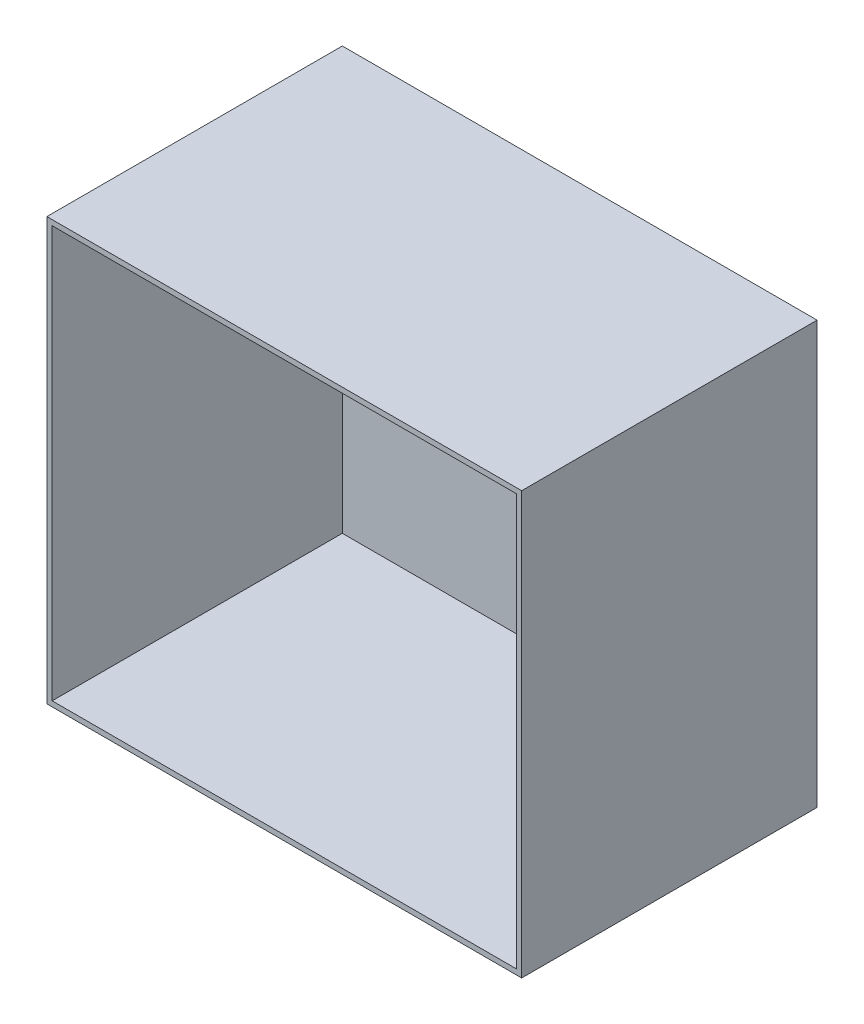
ISO-10303-21;
HEADER;
FILE_DESCRIPTION(('STEP AP214'),'2;1');
FILE_NAME('part.step','',(''),(''),'','','');
FILE_SCHEMA(('AUTOMOTIVE_DESIGN { 1 0 10303 214 1 1 1 1 }'));
ENDSEC;
DATA;
#1=APPLICATION_CONTEXT('core data for automotive mechanical design processes');
#2=APPLICATION_PROTOCOL_DEFINITION('international standard','automotive_design',2000,#1);
#3=PRODUCT_CONTEXT('',#1,'mechanical');
#4=PRODUCT('Part','Part','',(#3));
#5=PRODUCT_RELATED_PRODUCT_CATEGORY('part','',(#4));
#6=PRODUCT_DEFINITION_FORMATION('','',#4);
#7=PRODUCT_DEFINITION_CONTEXT('part definition',#1,'design');
#8=PRODUCT_DEFINITION('design','',#6,#7);
#9=PRODUCT_DEFINITION_SHAPE('','',#8);
#10=(LENGTH_UNIT() NAMED_UNIT(*) SI_UNIT(.MILLI.,.METRE.));
#11=(NAMED_UNIT(*) PLANE_ANGLE_UNIT() SI_UNIT($,.RADIAN.));
#12=(NAMED_UNIT(*) SI_UNIT($,.STERADIAN.) SOLID_ANGLE_UNIT());
#13=UNCERTAINTY_MEASURE_WITH_UNIT(LENGTH_MEASURE(1.E-05),#10,'distance_accuracy_value','');
#14=(GEOMETRIC_REPRESENTATION_CONTEXT(3) GLOBAL_UNCERTAINTY_ASSIGNED_CONTEXT((#13)) GLOBAL_UNIT_ASSIGNED_CONTEXT((#10,
#11,#12)) REPRESENTATION_CONTEXT('',''));
#15=CARTESIAN_POINT('',(0.,0.,0.));
#16=DIRECTION('',(0.,0.,1.));
#17=DIRECTION('',(1.,0.,0.));
#18=AXIS2_PLACEMENT_3D('',#15,#16,#17);
#19=CARTESIAN_POINT('',(-78.,0.,102.));
#20=DIRECTION('',(1.,0.,0.));
#21=DIRECTION('',(0.,0.,-1.));
#22=AXIS2_PLACEMENT_3D('',#19,#20,#21);
#23=PLANE('',#22);
#24=DIRECTION('',(0.,-1.,0.));
#25=VECTOR('',#24,1.);
#26=CARTESIAN_POINT('',(-78.,0.,2.));
#27=LINE('',#26,#25);
#28=CARTESIAN_POINT('',(-78.,78.,2.));
#29=VERTEX_POINT('',#28);
#30=CARTESIAN_POINT('',(-78.,-78.,2.));
#31=VERTEX_POINT('',#30);
#32=EDGE_CURVE('E140',#29,#31,#27,.T.);
#33=ORIENTED_EDGE('',*,*,#32,.F.);
#34=DIRECTION('',(0.,0.,-1.));
#35=VECTOR('',#34,1.);
#36=CARTESIAN_POINT('',(-78.,78.,102.));
#37=LINE('',#36,#35);
#38=CARTESIAN_POINT('',(-78.,78.,112.));
#39=VERTEX_POINT('',#38);
#40=EDGE_CURVE('E148',#39,#29,#37,.T.);
#41=ORIENTED_EDGE('',*,*,#40,.F.);
#42=DIRECTION('',(0.,-1.,0.));
#43=VECTOR('',#42,1.);
#44=CARTESIAN_POINT('',(-78.,78.,112.));
#45=LINE('',#44,#43);
#46=CARTESIAN_POINT('',(-78.,-78.,112.));
#47=VERTEX_POINT('',#46);
#48=EDGE_CURVE('E124',#39,#47,#45,.T.);
#49=ORIENTED_EDGE('',*,*,#48,.T.);
#50=DIRECTION('',(0.,0.,-1.));
#51=VECTOR('',#50,1.);
#52=CARTESIAN_POINT('',(-78.,-78.,102.));
#53=LINE('',#52,#51);
#54=EDGE_CURVE('E110',#47,#31,#53,.T.);
#55=ORIENTED_EDGE('',*,*,#54,.T.);
#56=EDGE_LOOP('',(#33,#41,#49,#55));
#57=FACE_BOUND('',#56,.T.);
#58=ADVANCED_FACE('F37',(#57),#23,.T.);
#59=CARTESIAN_POINT('',(0.,78.,102.));
#60=DIRECTION('',(0.,-1.,0.));
#61=DIRECTION('',(0.,0.,-1.));
#62=AXIS2_PLACEMENT_3D('',#59,#60,#61);
#63=PLANE('',#62);
#64=DIRECTION('',(-1.,0.,0.));
#65=VECTOR('',#64,1.);
#66=CARTESIAN_POINT('',(0.,78.,2.));
#67=LINE('',#66,#65);
#68=CARTESIAN_POINT('',(98.,78.,2.));
#69=VERTEX_POINT('',#68);
#70=EDGE_CURVE('E52',#69,#29,#67,.T.);
#71=ORIENTED_EDGE('',*,*,#70,.F.);
#72=DIRECTION('',(0.,0.,-1.));
#73=VECTOR('',#72,1.);
#74=CARTESIAN_POINT('',(98.,78.,102.));
#75=LINE('',#74,#73);
#76=CARTESIAN_POINT('',(98.,78.,112.));
#77=VERTEX_POINT('',#76);
#78=EDGE_CURVE('E109',#77,#69,#75,.T.);
#79=ORIENTED_EDGE('',*,*,#78,.F.);
#80=DIRECTION('',(-1.,0.,0.));
#81=VECTOR('',#80,1.);
#82=CARTESIAN_POINT('',(98.,78.,112.));
#83=LINE('',#82,#81);
#84=EDGE_CURVE('E122',#77,#39,#83,.T.);
#85=ORIENTED_EDGE('',*,*,#84,.T.);
#86=ORIENTED_EDGE('',*,*,#40,.T.);
#87=EDGE_LOOP('',(#71,#79,#85,#86));
#88=FACE_BOUND('',#87,.T.);
#89=ADVANCED_FACE('F193',(#88),#63,.T.);
#90=CARTESIAN_POINT('',(98.,0.,102.));
#91=DIRECTION('',(-1.,0.,0.));
#92=DIRECTION('',(0.,0.,1.));
#93=AXIS2_PLACEMENT_3D('',#90,#91,#92);
#94=PLANE('',#93);
#95=DIRECTION('',(0.,1.,0.));
#96=VECTOR('',#95,1.);
#97=CARTESIAN_POINT('',(98.,0.,2.));
#98=LINE('',#97,#96);
#99=CARTESIAN_POINT('',(98.,-78.,2.));
#100=VERTEX_POINT('',#99);
#101=EDGE_CURVE('E57',#100,#69,#98,.T.);
#102=ORIENTED_EDGE('',*,*,#101,.F.);
#103=DIRECTION('',(0.,0.,-1.));
#104=VECTOR('',#103,1.);
#105=CARTESIAN_POINT('',(98.,-78.,102.));
#106=LINE('',#105,#104);
#107=CARTESIAN_POINT('',(98.,-78.,112.));
#108=VERTEX_POINT('',#107);
#109=EDGE_CURVE('E101',#108,#100,#106,.T.);
#110=ORIENTED_EDGE('',*,*,#109,.F.);
#111=DIRECTION('',(0.,1.,0.));
#112=VECTOR('',#111,1.);
#113=CARTESIAN_POINT('',(98.,-78.,112.));
#114=LINE('',#113,#112);
#115=EDGE_CURVE('E105',#108,#77,#114,.T.);
#116=ORIENTED_EDGE('',*,*,#115,.T.);
#117=ORIENTED_EDGE('',*,*,#78,.T.);
#118=EDGE_LOOP('',(#102,#110,#116,#117));
#119=FACE_BOUND('',#118,.T.);
#120=ADVANCED_FACE('F103',(#119),#94,.T.);
#121=CARTESIAN_POINT('',(0.,-78.,102.));
#122=DIRECTION('',(0.,1.,0.));
#123=DIRECTION('',(0.,0.,1.));
#124=AXIS2_PLACEMENT_3D('',#121,#122,#123);
#125=PLANE('',#124);
#126=DIRECTION('',(1.,0.,0.));
#127=VECTOR('',#126,1.);
#128=CARTESIAN_POINT('',(0.,-78.,2.));
#129=LINE('',#128,#127);
#130=EDGE_CURVE('E144',#31,#100,#129,.T.);
#131=ORIENTED_EDGE('',*,*,#130,.F.);
#132=ORIENTED_EDGE('',*,*,#54,.F.);
#133=DIRECTION('',(1.,0.,0.));
#134=VECTOR('',#133,1.);
#135=CARTESIAN_POINT('',(-78.,-78.,112.));
#136=LINE('',#135,#134);
#137=EDGE_CURVE('E113',#47,#108,#136,.T.);
#138=ORIENTED_EDGE('',*,*,#137,.T.);
#139=ORIENTED_EDGE('',*,*,#109,.T.);
#140=EDGE_LOOP('',(#131,#132,#138,#139));
#141=FACE_BOUND('',#140,.T.);
#142=ADVANCED_FACE('F114',(#141),#125,.T.);
#143=CARTESIAN_POINT('',(0.,0.,2.));
#144=DIRECTION('',(0.,0.,1.));
#145=DIRECTION('',(1.,0.,0.));
#146=AXIS2_PLACEMENT_3D('',#143,#144,#145);
#147=PLANE('',#146);
#148=ORIENTED_EDGE('',*,*,#32,.T.);
#149=ORIENTED_EDGE('',*,*,#130,.T.);
#150=ORIENTED_EDGE('',*,*,#101,.T.);
#151=ORIENTED_EDGE('',*,*,#70,.T.);
#152=EDGE_LOOP('',(#148,#149,#150,#151));
#153=FACE_BOUND('',#152,.T.);
#154=ADVANCED_FACE('F207',(#153),#147,.T.);
#155=CARTESIAN_POINT('',(0.,0.,112.));
#156=DIRECTION('',(0.,0.,1.));
#157=DIRECTION('',(1.,0.,0.));
#158=AXIS2_PLACEMENT_3D('',#155,#156,#157);
#159=PLANE('',#158);
#160=DIRECTION('',(0.,1.,0.));
#161=VECTOR('',#160,1.);
#162=CARTESIAN_POINT('',(100.,-80.,112.));
#163=LINE('',#162,#161);
#164=CARTESIAN_POINT('',(100.,-80.,112.));
#165=VERTEX_POINT('',#164);
#166=CARTESIAN_POINT('',(100.,80.,112.));
#167=VERTEX_POINT('',#166);
#168=EDGE_CURVE('E128',#165,#167,#163,.T.);
#169=ORIENTED_EDGE('',*,*,#168,.T.);
#170=DIRECTION('',(-1.,0.,0.));
#171=VECTOR('',#170,1.);
#172=CARTESIAN_POINT('',(100.,80.,112.));
#173=LINE('',#172,#171);
#174=CARTESIAN_POINT('',(-80.,80.,112.));
#175=VERTEX_POINT('',#174);
#176=EDGE_CURVE('E131',#167,#175,#173,.T.);
#177=ORIENTED_EDGE('',*,*,#176,.T.);
#178=DIRECTION('',(0.,-1.,0.));
#179=VECTOR('',#178,1.);
#180=CARTESIAN_POINT('',(-80.,80.,112.));
#181=LINE('',#180,#179);
#182=CARTESIAN_POINT('',(-80.,-80.,112.));
#183=VERTEX_POINT('',#182);
#184=EDGE_CURVE('E134',#175,#183,#181,.T.);
#185=ORIENTED_EDGE('',*,*,#184,.T.);
#186=DIRECTION('',(1.,0.,0.));
#187=VECTOR('',#186,1.);
#188=CARTESIAN_POINT('',(-80.,-80.,112.));
#189=LINE('',#188,#187);
#190=EDGE_CURVE('E137',#183,#165,#189,.T.);
#191=ORIENTED_EDGE('',*,*,#190,.T.);
#192=EDGE_LOOP('',(#169,#177,#185,#191));
#193=FACE_BOUND('',#192,.T.);
#194=ORIENTED_EDGE('',*,*,#115,.F.);
#195=ORIENTED_EDGE('',*,*,#137,.F.);
#196=ORIENTED_EDGE('',*,*,#48,.F.);
#197=ORIENTED_EDGE('',*,*,#84,.F.);
#198=EDGE_LOOP('',(#194,#195,#196,#197));
#199=FACE_BOUND('',#198,.T.);
#200=ADVANCED_FACE('F120',(#193,#199),#159,.T.);
#201=CARTESIAN_POINT('',(0.,0.,0.));
#202=DIRECTION('',(0.,0.,1.));
#203=DIRECTION('',(1.,0.,0.));
#204=AXIS2_PLACEMENT_3D('',#201,#202,#203);
#205=PLANE('',#204);
#206=DIRECTION('',(0.,-1.,0.));
#207=VECTOR('',#206,1.);
#208=CARTESIAN_POINT('',(-80.,-80.,0.));
#209=LINE('',#208,#207);
#210=CARTESIAN_POINT('',(-80.,80.,0.));
#211=VERTEX_POINT('',#210);
#212=CARTESIAN_POINT('',(-80.,-80.,0.));
#213=VERTEX_POINT('',#212);
#214=EDGE_CURVE('E158',#211,#213,#209,.T.);
#215=ORIENTED_EDGE('',*,*,#214,.F.);
#216=DIRECTION('',(-1.,0.,0.));
#217=VECTOR('',#216,1.);
#218=CARTESIAN_POINT('',(80.,80.,0.));
#219=LINE('',#218,#217);
#220=CARTESIAN_POINT('',(100.,80.,0.));
#221=VERTEX_POINT('',#220);
#222=EDGE_CURVE('E163',#221,#211,#219,.T.);
#223=ORIENTED_EDGE('',*,*,#222,.F.);
#224=DIRECTION('',(0.,1.,0.));
#225=VECTOR('',#224,1.);
#226=CARTESIAN_POINT('',(100.,-80.,0.));
#227=LINE('',#226,#225);
#228=CARTESIAN_POINT('',(100.,-80.,0.));
#229=VERTEX_POINT('',#228);
#230=EDGE_CURVE('E153',#229,#221,#227,.T.);
#231=ORIENTED_EDGE('',*,*,#230,.F.);
#232=DIRECTION('',(1.,0.,0.));
#233=VECTOR('',#232,1.);
#234=CARTESIAN_POINT('',(80.,-80.,0.));
#235=LINE('',#234,#233);
#236=EDGE_CURVE('E161',#213,#229,#235,.T.);
#237=ORIENTED_EDGE('',*,*,#236,.F.);
#238=EDGE_LOOP('',(#215,#223,#231,#237));
#239=FACE_BOUND('',#238,.T.);
#240=ADVANCED_FACE('F171',(#239),#205,.F.);
#241=CARTESIAN_POINT('',(100.,0.,0.));
#242=DIRECTION('',(1.,0.,0.));
#243=DIRECTION('',(0.,0.,-1.));
#244=AXIS2_PLACEMENT_3D('',#241,#242,#243);
#245=PLANE('',#244);
#246=DIRECTION('',(0.,0.,-1.));
#247=VECTOR('',#246,1.);
#248=CARTESIAN_POINT('',(100.,-80.,2.));
#249=LINE('',#248,#247);
#250=EDGE_CURVE('E150',#165,#229,#249,.T.);
#251=ORIENTED_EDGE('',*,*,#250,.T.);
#252=ORIENTED_EDGE('',*,*,#230,.T.);
#253=DIRECTION('',(0.,0.,1.));
#254=VECTOR('',#253,1.);
#255=CARTESIAN_POINT('',(100.,80.,0.));
#256=LINE('',#255,#254);
#257=EDGE_CURVE('E156',#221,#167,#256,.T.);
#258=ORIENTED_EDGE('',*,*,#257,.T.);
#259=ORIENTED_EDGE('',*,*,#168,.F.);
#260=EDGE_LOOP('',(#251,#252,#258,#259));
#261=FACE_BOUND('',#260,.T.);
#262=ADVANCED_FACE('F181',(#261),#245,.T.);
#263=CARTESIAN_POINT('',(80.,-80.,2.));
#264=DIRECTION('',(0.,1.,0.));
#265=DIRECTION('',(-1.,0.,0.));
#266=AXIS2_PLACEMENT_3D('',#263,#264,#265);
#267=PLANE('',#266);
#268=ORIENTED_EDGE('',*,*,#236,.T.);
#269=ORIENTED_EDGE('',*,*,#250,.F.);
#270=ORIENTED_EDGE('',*,*,#190,.F.);
#271=DIRECTION('',(0.,0.,-1.));
#272=VECTOR('',#271,1.);
#273=CARTESIAN_POINT('',(-80.,-80.,2.));
#274=LINE('',#273,#272);
#275=EDGE_CURVE('E11',#183,#213,#274,.T.);
#276=ORIENTED_EDGE('',*,*,#275,.T.);
#277=EDGE_LOOP('',(#268,#269,#270,#276));
#278=FACE_BOUND('',#277,.T.);
#279=ADVANCED_FACE('F175',(#278),#267,.F.);
#280=CARTESIAN_POINT('',(-80.,-80.,2.));
#281=DIRECTION('',(1.,0.,0.));
#282=DIRECTION('',(0.,0.,-1.));
#283=AXIS2_PLACEMENT_3D('',#280,#281,#282);
#284=PLANE('',#283);
#285=ORIENTED_EDGE('',*,*,#214,.T.);
#286=ORIENTED_EDGE('',*,*,#275,.F.);
#287=ORIENTED_EDGE('',*,*,#184,.F.);
#288=DIRECTION('',(0.,0.,-1.));
#289=VECTOR('',#288,1.);
#290=CARTESIAN_POINT('',(-80.,80.,2.));
#291=LINE('',#290,#289);
#292=EDGE_CURVE('E45',#175,#211,#291,.T.);
#293=ORIENTED_EDGE('',*,*,#292,.T.);
#294=EDGE_LOOP('',(#285,#286,#287,#293));
#295=FACE_BOUND('',#294,.T.);
#296=ADVANCED_FACE('F39',(#295),#284,.F.);
#297=CARTESIAN_POINT('',(80.,80.,2.));
#298=DIRECTION('',(0.,-1.,0.));
#299=DIRECTION('',(1.,0.,0.));
#300=AXIS2_PLACEMENT_3D('',#297,#298,#299);
#301=PLANE('',#300);
#302=ORIENTED_EDGE('',*,*,#222,.T.);
#303=ORIENTED_EDGE('',*,*,#292,.F.);
#304=ORIENTED_EDGE('',*,*,#176,.F.);
#305=ORIENTED_EDGE('',*,*,#257,.F.);
#306=EDGE_LOOP('',(#302,#303,#304,#305));
#307=FACE_BOUND('',#306,.T.);
#308=ADVANCED_FACE('F179',(#307),#301,.F.);
#309=CLOSED_SHELL('',(#58,#89,#120,#142,#154,#200,#240,#262,#279,#296,#308));
#310=MANIFOLD_SOLID_BREP('B2',#309);
#311=ADVANCED_BREP_SHAPE_REPRESENTATION('',(#18,#310),#14);
#312=SHAPE_DEFINITION_REPRESENTATION(#9,#311);
ENDSEC;
END-ISO-10303-21;
